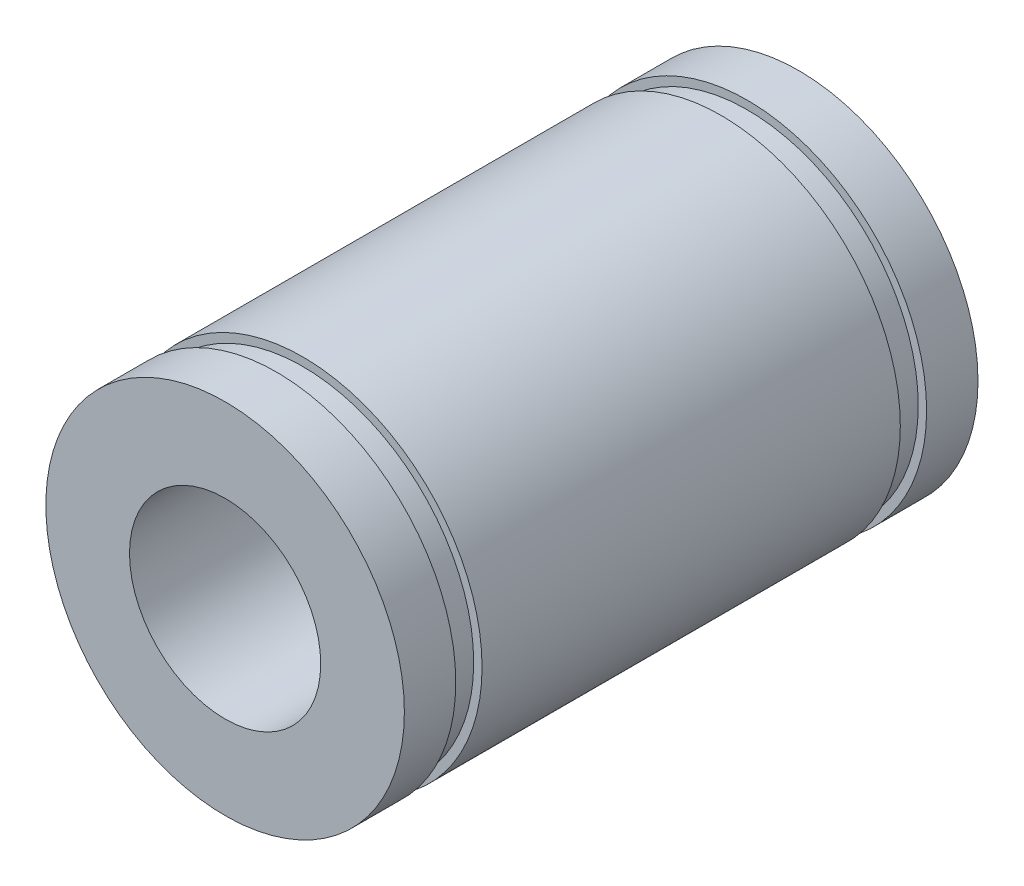
ISO-10303-21;
HEADER;
FILE_DESCRIPTION(('STEP AP214'),'2;1');
FILE_NAME('part.step','',(''),(''),'','','');
FILE_SCHEMA(('AUTOMOTIVE_DESIGN { 1 0 10303 214 1 1 1 1 }'));
ENDSEC;
DATA;
#1=APPLICATION_CONTEXT('core data for automotive mechanical design processes');
#2=APPLICATION_PROTOCOL_DEFINITION('international standard','automotive_design',2000,#1);
#3=PRODUCT_CONTEXT('',#1,'mechanical');
#4=PRODUCT('Part','Part','',(#3));
#5=PRODUCT_RELATED_PRODUCT_CATEGORY('part','',(#4));
#6=PRODUCT_DEFINITION_FORMATION('','',#4);
#7=PRODUCT_DEFINITION_CONTEXT('part definition',#1,'design');
#8=PRODUCT_DEFINITION('design','',#6,#7);
#9=PRODUCT_DEFINITION_SHAPE('','',#8);
#10=(LENGTH_UNIT() NAMED_UNIT(*) SI_UNIT(.MILLI.,.METRE.));
#11=(NAMED_UNIT(*) PLANE_ANGLE_UNIT() SI_UNIT($,.RADIAN.));
#12=(NAMED_UNIT(*) SI_UNIT($,.STERADIAN.) SOLID_ANGLE_UNIT());
#13=UNCERTAINTY_MEASURE_WITH_UNIT(LENGTH_MEASURE(1.E-05),#10,'distance_accuracy_value','');
#14=(GEOMETRIC_REPRESENTATION_CONTEXT(3) GLOBAL_UNCERTAINTY_ASSIGNED_CONTEXT((#13)) GLOBAL_UNIT_ASSIGNED_CONTEXT((#10,
#11,#12)) REPRESENTATION_CONTEXT('',''));
#15=CARTESIAN_POINT('',(0.,0.,0.));
#16=DIRECTION('',(0.,0.,1.));
#17=DIRECTION('',(1.,0.,0.));
#18=AXIS2_PLACEMENT_3D('',#15,#16,#17);
#19=CARTESIAN_POINT('',(0.,0.,0.));
#20=DIRECTION('',(0.,0.,1.));
#21=DIRECTION('',(1.,0.,0.));
#22=AXIS2_PLACEMENT_3D('',#19,#20,#21);
#23=CYLINDRICAL_SURFACE('',#22,4.);
#24=CARTESIAN_POINT('',(0.,0.,0.));
#25=DIRECTION('',(0.,0.,1.));
#26=DIRECTION('',(1.,0.,0.));
#27=AXIS2_PLACEMENT_3D('',#24,#25,#26);
#28=CIRCLE('',#27,4.);
#29=CARTESIAN_POINT('',(4.,0.,0.));
#30=VERTEX_POINT('',#29);
#31=EDGE_CURVE('E52',#30,#30,#28,.F.);
#32=ORIENTED_EDGE('',*,*,#31,.T.);
#33=EDGE_LOOP('',(#32));
#34=FACE_BOUND('',#33,.T.);
#35=CARTESIAN_POINT('',(0.,0.,24.));
#36=DIRECTION('',(0.,0.,1.));
#37=DIRECTION('',(1.,0.,0.));
#38=AXIS2_PLACEMENT_3D('',#35,#36,#37);
#39=CIRCLE('',#38,4.);
#40=CARTESIAN_POINT('',(4.,0.,24.));
#41=VERTEX_POINT('',#40);
#42=EDGE_CURVE('E18',#41,#41,#39,.F.);
#43=ORIENTED_EDGE('',*,*,#42,.F.);
#44=EDGE_LOOP('',(#43));
#45=FACE_BOUND('',#44,.T.);
#46=ADVANCED_FACE('F15',(#34,#45),#23,.F.);
#47=CARTESIAN_POINT('',(0.,0.,24.));
#48=DIRECTION('',(0.,0.,1.));
#49=DIRECTION('',(1.,0.,0.));
#50=AXIS2_PLACEMENT_3D('',#47,#48,#49);
#51=PLANE('',#50);
#52=ORIENTED_EDGE('',*,*,#42,.T.);
#53=EDGE_LOOP('',(#52));
#54=FACE_BOUND('',#53,.T.);
#55=CARTESIAN_POINT('',(0.,0.,24.));
#56=DIRECTION('',(0.,0.,1.));
#57=DIRECTION('',(1.,0.,0.));
#58=AXIS2_PLACEMENT_3D('',#55,#56,#57);
#59=CIRCLE('',#58,7.5);
#60=CARTESIAN_POINT('',(7.5,0.,24.));
#61=VERTEX_POINT('',#60);
#62=EDGE_CURVE('E50',#61,#61,#59,.F.);
#63=ORIENTED_EDGE('',*,*,#62,.F.);
#64=EDGE_LOOP('',(#63));
#65=FACE_BOUND('',#64,.T.);
#66=ADVANCED_FACE('F59',(#54,#65),#51,.T.);
#67=CARTESIAN_POINT('',(0.,0.,0.));
#68=DIRECTION('',(0.,0.,1.));
#69=DIRECTION('',(1.,0.,0.));
#70=AXIS2_PLACEMENT_3D('',#67,#68,#69);
#71=PLANE('',#70);
#72=ORIENTED_EDGE('',*,*,#31,.F.);
#73=EDGE_LOOP('',(#72));
#74=FACE_BOUND('',#73,.T.);
#75=CARTESIAN_POINT('',(0.,0.,0.));
#76=DIRECTION('',(0.,0.,1.));
#77=DIRECTION('',(1.,0.,0.));
#78=AXIS2_PLACEMENT_3D('',#75,#76,#77);
#79=CIRCLE('',#78,7.5);
#80=CARTESIAN_POINT('',(7.5,0.,0.));
#81=VERTEX_POINT('',#80);
#82=EDGE_CURVE('E47',#81,#81,#79,.T.);
#83=ORIENTED_EDGE('',*,*,#82,.F.);
#84=EDGE_LOOP('',(#83));
#85=FACE_BOUND('',#84,.T.);
#86=ADVANCED_FACE('F67',(#74,#85),#71,.F.);
#87=CARTESIAN_POINT('',(0.,0.,21.85));
#88=DIRECTION('',(0.,0.,1.));
#89=DIRECTION('',(1.,0.,0.));
#90=AXIS2_PLACEMENT_3D('',#87,#88,#89);
#91=CYLINDRICAL_SURFACE('',#90,7.5);
#92=CARTESIAN_POINT('',(0.,0.,21.85));
#93=DIRECTION('',(0.,0.,1.));
#94=DIRECTION('',(1.,0.,0.));
#95=AXIS2_PLACEMENT_3D('',#92,#93,#94);
#96=CIRCLE('',#95,7.5);
#97=CARTESIAN_POINT('',(7.5,0.,21.85));
#98=VERTEX_POINT('',#97);
#99=EDGE_CURVE('E44',#98,#98,#96,.T.);
#100=ORIENTED_EDGE('',*,*,#99,.T.);
#101=EDGE_LOOP('',(#100));
#102=FACE_BOUND('',#101,.T.);
#103=ORIENTED_EDGE('',*,*,#62,.T.);
#104=EDGE_LOOP('',(#103));
#105=FACE_BOUND('',#104,.T.);
#106=ADVANCED_FACE('F102',(#102,#105),#91,.T.);
#107=CARTESIAN_POINT('',(0.,0.,0.));
#108=DIRECTION('',(0.,0.,1.));
#109=DIRECTION('',(1.,0.,0.));
#110=AXIS2_PLACEMENT_3D('',#107,#108,#109);
#111=CYLINDRICAL_SURFACE('',#110,7.5);
#112=ORIENTED_EDGE('',*,*,#82,.T.);
#113=EDGE_LOOP('',(#112));
#114=FACE_BOUND('',#113,.T.);
#115=CARTESIAN_POINT('',(0.,0.,2.15));
#116=DIRECTION('',(0.,0.,1.));
#117=DIRECTION('',(1.,0.,0.));
#118=AXIS2_PLACEMENT_3D('',#115,#116,#117);
#119=CIRCLE('',#118,7.5);
#120=CARTESIAN_POINT('',(7.5,0.,2.15));
#121=VERTEX_POINT('',#120);
#122=EDGE_CURVE('E41',#121,#121,#119,.T.);
#123=ORIENTED_EDGE('',*,*,#122,.F.);
#124=EDGE_LOOP('',(#123));
#125=FACE_BOUND('',#124,.T.);
#126=ADVANCED_FACE('F98',(#114,#125),#111,.T.);
#127=CARTESIAN_POINT('',(0.,0.,21.85));
#128=DIRECTION('',(0.,0.,1.));
#129=DIRECTION('',(1.,0.,0.));
#130=AXIS2_PLACEMENT_3D('',#127,#128,#129);
#131=PLANE('',#130);
#132=CARTESIAN_POINT('',(0.,0.,21.85));
#133=DIRECTION('',(0.,0.,1.));
#134=DIRECTION('',(1.,0.,0.));
#135=AXIS2_PLACEMENT_3D('',#132,#133,#134);
#136=CIRCLE('',#135,7.15);
#137=CARTESIAN_POINT('',(7.15,0.,21.85));
#138=VERTEX_POINT('',#137);
#139=EDGE_CURVE('E38',#138,#138,#136,.F.);
#140=ORIENTED_EDGE('',*,*,#139,.F.);
#141=EDGE_LOOP('',(#140));
#142=FACE_BOUND('',#141,.T.);
#143=ORIENTED_EDGE('',*,*,#99,.F.);
#144=EDGE_LOOP('',(#143));
#145=FACE_BOUND('',#144,.T.);
#146=ADVANCED_FACE('F94',(#142,#145),#131,.F.);
#147=CARTESIAN_POINT('',(0.,0.,2.15));
#148=DIRECTION('',(0.,0.,1.));
#149=DIRECTION('',(1.,0.,0.));
#150=AXIS2_PLACEMENT_3D('',#147,#148,#149);
#151=PLANE('',#150);
#152=CARTESIAN_POINT('',(0.,0.,2.15));
#153=DIRECTION('',(0.,0.,1.));
#154=DIRECTION('',(1.,0.,0.));
#155=AXIS2_PLACEMENT_3D('',#152,#153,#154);
#156=CIRCLE('',#155,7.15);
#157=CARTESIAN_POINT('',(7.15,0.,2.15));
#158=VERTEX_POINT('',#157);
#159=EDGE_CURVE('E35',#158,#158,#156,.T.);
#160=ORIENTED_EDGE('',*,*,#159,.F.);
#161=EDGE_LOOP('',(#160));
#162=FACE_BOUND('',#161,.T.);
#163=ORIENTED_EDGE('',*,*,#122,.T.);
#164=EDGE_LOOP('',(#163));
#165=FACE_BOUND('',#164,.T.);
#166=ADVANCED_FACE('F90',(#162,#165),#151,.T.);
#167=CARTESIAN_POINT('',(0.,0.,3.25));
#168=DIRECTION('',(0.,0.,1.));
#169=DIRECTION('',(1.,0.,0.));
#170=AXIS2_PLACEMENT_3D('',#167,#168,#169);
#171=CYLINDRICAL_SURFACE('',#170,7.15);
#172=CARTESIAN_POINT('',(0.,0.,20.75));
#173=DIRECTION('',(0.,0.,1.));
#174=DIRECTION('',(1.,0.,0.));
#175=AXIS2_PLACEMENT_3D('',#172,#173,#174);
#176=CIRCLE('',#175,7.15);
#177=CARTESIAN_POINT('',(7.15,0.,20.75));
#178=VERTEX_POINT('',#177);
#179=EDGE_CURVE('E32',#178,#178,#176,.F.);
#180=ORIENTED_EDGE('',*,*,#179,.F.);
#181=EDGE_LOOP('',(#180));
#182=FACE_BOUND('',#181,.T.);
#183=ORIENTED_EDGE('',*,*,#139,.T.);
#184=EDGE_LOOP('',(#183));
#185=FACE_BOUND('',#184,.T.);
#186=ADVANCED_FACE('F86',(#182,#185),#171,.T.);
#187=CARTESIAN_POINT('',(0.,0.,0.));
#188=DIRECTION('',(0.,0.,1.));
#189=DIRECTION('',(1.,0.,0.));
#190=AXIS2_PLACEMENT_3D('',#187,#188,#189);
#191=CYLINDRICAL_SURFACE('',#190,7.15);
#192=ORIENTED_EDGE('',*,*,#159,.T.);
#193=EDGE_LOOP('',(#192));
#194=FACE_BOUND('',#193,.T.);
#195=CARTESIAN_POINT('',(0.,0.,3.25));
#196=DIRECTION('',(0.,0.,1.));
#197=DIRECTION('',(1.,0.,0.));
#198=AXIS2_PLACEMENT_3D('',#195,#196,#197);
#199=CIRCLE('',#198,7.15);
#200=CARTESIAN_POINT('',(7.15,0.,3.25));
#201=VERTEX_POINT('',#200);
#202=EDGE_CURVE('E27',#201,#201,#199,.F.);
#203=ORIENTED_EDGE('',*,*,#202,.T.);
#204=EDGE_LOOP('',(#203));
#205=FACE_BOUND('',#204,.T.);
#206=ADVANCED_FACE('F82',(#194,#205),#191,.T.);
#207=CARTESIAN_POINT('',(0.,0.,20.75));
#208=DIRECTION('',(0.,0.,1.));
#209=DIRECTION('',(1.,0.,0.));
#210=AXIS2_PLACEMENT_3D('',#207,#208,#209);
#211=PLANE('',#210);
#212=ORIENTED_EDGE('',*,*,#179,.T.);
#213=EDGE_LOOP('',(#212));
#214=FACE_BOUND('',#213,.T.);
#215=CARTESIAN_POINT('',(0.,0.,20.75));
#216=DIRECTION('',(0.,0.,1.));
#217=DIRECTION('',(1.,0.,0.));
#218=AXIS2_PLACEMENT_3D('',#215,#216,#217);
#219=CIRCLE('',#218,7.5);
#220=CARTESIAN_POINT('',(7.5,0.,20.75));
#221=VERTEX_POINT('',#220);
#222=EDGE_CURVE('E22',#221,#221,#219,.F.);
#223=ORIENTED_EDGE('',*,*,#222,.F.);
#224=EDGE_LOOP('',(#223));
#225=FACE_BOUND('',#224,.T.);
#226=ADVANCED_FACE('F75',(#214,#225),#211,.T.);
#227=CARTESIAN_POINT('',(0.,0.,3.25));
#228=DIRECTION('',(0.,0.,1.));
#229=DIRECTION('',(1.,0.,0.));
#230=AXIS2_PLACEMENT_3D('',#227,#228,#229);
#231=PLANE('',#230);
#232=ORIENTED_EDGE('',*,*,#202,.F.);
#233=EDGE_LOOP('',(#232));
#234=FACE_BOUND('',#233,.T.);
#235=CARTESIAN_POINT('',(0.,0.,3.25));
#236=DIRECTION('',(0.,0.,1.));
#237=DIRECTION('',(1.,0.,0.));
#238=AXIS2_PLACEMENT_3D('',#235,#236,#237);
#239=CIRCLE('',#238,7.5);
#240=CARTESIAN_POINT('',(7.5,0.,3.25));
#241=VERTEX_POINT('',#240);
#242=EDGE_CURVE('E10',#241,#241,#239,.T.);
#243=ORIENTED_EDGE('',*,*,#242,.F.);
#244=EDGE_LOOP('',(#243));
#245=FACE_BOUND('',#244,.T.);
#246=ADVANCED_FACE('F70',(#234,#245),#231,.F.);
#247=CARTESIAN_POINT('',(0.,0.,3.25));
#248=DIRECTION('',(0.,0.,1.));
#249=DIRECTION('',(1.,0.,0.));
#250=AXIS2_PLACEMENT_3D('',#247,#248,#249);
#251=CYLINDRICAL_SURFACE('',#250,7.5);
#252=ORIENTED_EDGE('',*,*,#242,.T.);
#253=EDGE_LOOP('',(#252));
#254=FACE_BOUND('',#253,.T.);
#255=ORIENTED_EDGE('',*,*,#222,.T.);
#256=EDGE_LOOP('',(#255));
#257=FACE_BOUND('',#256,.T.);
#258=ADVANCED_FACE('F68',(#254,#257),#251,.T.);
#259=CLOSED_SHELL('',(#46,#66,#86,#106,#126,#146,#166,#186,#206,#226,#246,#258));
#260=MANIFOLD_SOLID_BREP('B1',#259);
#261=ADVANCED_BREP_SHAPE_REPRESENTATION('',(#18,#260),#14);
#262=SHAPE_DEFINITION_REPRESENTATION(#9,#261);
ENDSEC;
END-ISO-10303-21;
